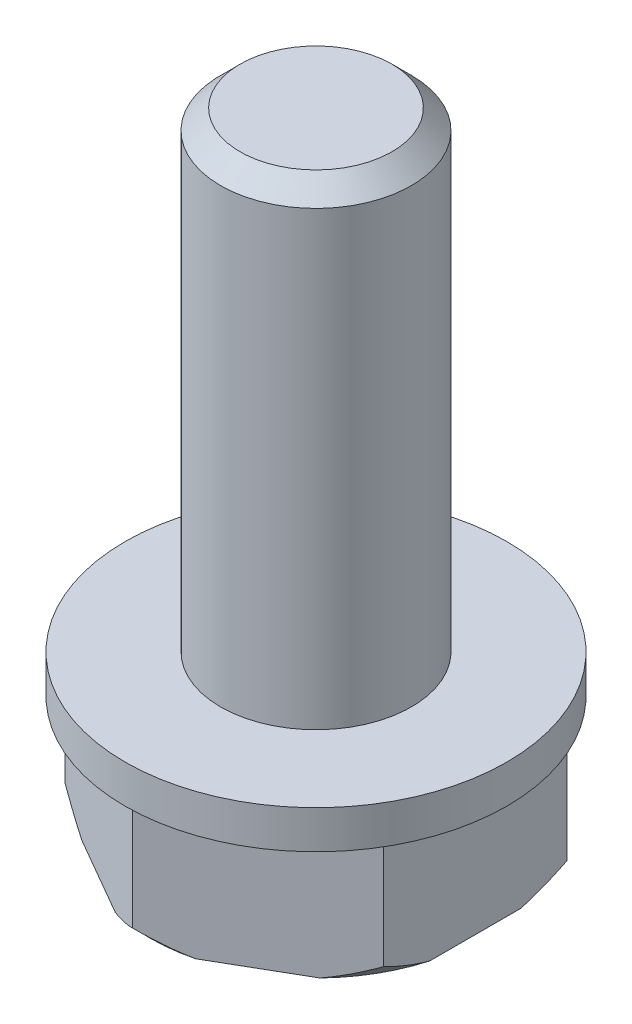
ISO-10303-21;
HEADER;
FILE_DESCRIPTION(('STEP AP214'),'2;1');
FILE_NAME('part.step','',(''),(''),'','','');
FILE_SCHEMA(('AUTOMOTIVE_DESIGN { 1 0 10303 214 1 1 1 1 }'));
ENDSEC;
DATA;
#1=APPLICATION_CONTEXT('core data for automotive mechanical design processes');
#2=APPLICATION_PROTOCOL_DEFINITION('international standard','automotive_design',2000,#1);
#3=PRODUCT_CONTEXT('',#1,'mechanical');
#4=PRODUCT('Part','Part','',(#3));
#5=PRODUCT_RELATED_PRODUCT_CATEGORY('part','',(#4));
#6=PRODUCT_DEFINITION_FORMATION('','',#4);
#7=PRODUCT_DEFINITION_CONTEXT('part definition',#1,'design');
#8=PRODUCT_DEFINITION('design','',#6,#7);
#9=PRODUCT_DEFINITION_SHAPE('','',#8);
#10=(LENGTH_UNIT() NAMED_UNIT(*) SI_UNIT(.MILLI.,.METRE.));
#11=(NAMED_UNIT(*) PLANE_ANGLE_UNIT() SI_UNIT($,.RADIAN.));
#12=(NAMED_UNIT(*) SI_UNIT($,.STERADIAN.) SOLID_ANGLE_UNIT());
#13=UNCERTAINTY_MEASURE_WITH_UNIT(LENGTH_MEASURE(1.E-05),#10,'distance_accuracy_value','');
#14=(GEOMETRIC_REPRESENTATION_CONTEXT(3) GLOBAL_UNCERTAINTY_ASSIGNED_CONTEXT((#13)) GLOBAL_UNIT_ASSIGNED_CONTEXT((#10,
#11,#12)) REPRESENTATION_CONTEXT('',''));
#15=CARTESIAN_POINT('',(0.,0.,0.));
#16=DIRECTION('',(0.,0.,1.));
#17=DIRECTION('',(1.,0.,0.));
#18=AXIS2_PLACEMENT_3D('',#15,#16,#17);
#19=CARTESIAN_POINT('',(22.6776695296637,96.5,-20.5644208756118));
#20=DIRECTION('',(-0.5,0.,0.866025403784439));
#21=DIRECTION('',(0.866025403784439,0.,0.5));
#22=AXIS2_PLACEMENT_3D('',#19,#20,#21);
#23=PLANE('',#22);
#24=DIRECTION('',(0.,-1.,0.));
#25=VECTOR('',#24,1.);
#26=CARTESIAN_POINT('',(22.6776695296637,96.5,-20.5644208756118));
#27=LINE('',#26,#25);
#28=CARTESIAN_POINT('',(22.6776695296637,50.5,-20.5644208756118));
#29=VERTEX_POINT('',#28);
#30=CARTESIAN_POINT('',(22.6776695296637,47.0735026918963,-20.5644208756118));
#31=VERTEX_POINT('',#30);
#32=EDGE_CURVE('E11',#29,#31,#27,.T.);
#33=ORIENTED_EDGE('',*,*,#32,.T.);
#34=CARTESIAN_POINT('',(21.414601217349,46.5,-21.2936537057316));
#35=CARTESIAN_POINT('',(21.4664537594648,46.5164440766261,-21.2637151211004));
#36=CARTESIAN_POINT('',(21.5180895158105,46.5337687545802,-21.2338904269128));
#37=CARTESIAN_POINT('',(21.6214874574526,46.5702823086314,-21.1741594018992));
#38=CARTESIAN_POINT('',(21.6732446970938,46.5894897238432,-21.1442558321939));
#39=CARTESIAN_POINT('',(21.7769756621481,46.6297670931507,-21.0843293780453));
#40=CARTESIAN_POINT('',(21.8289432219275,46.6508582920278,-21.054310131997));
#41=CARTESIAN_POINT('',(21.9331790081629,46.6949003649628,-20.9941094242253));
#42=CARTESIAN_POINT('',(21.9854399260141,46.7178745106764,-20.9639323574686));
#43=CARTESIAN_POINT('',(22.0903392794409,46.7656807395659,-20.9033725653862));
#44=CARTESIAN_POINT('',(22.1429693499514,46.7905375181192,-20.8729948770988));
#45=CARTESIAN_POINT('',(22.2486773209186,46.8421079012049,-20.8119895662206));
#46=CARTESIAN_POINT('',(22.3017459168783,46.8688470805479,-20.7813674698508));
#47=CARTESIAN_POINT('',(22.4083946755418,46.9241810640024,-20.7198294215317));
#48=CARTESIAN_POINT('',(22.4619647196344,46.9528018406309,-20.6889193342318));
#49=CARTESIAN_POINT('',(22.56967482855,47.0119007649667,-20.6267615953025));
#50=CARTESIAN_POINT('',(22.6238041115768,47.042404941688,-20.5955199875061));
#51=CARTESIAN_POINT('',(22.6776695296637,47.0735026918963,-20.5644208756118));
#52=B_SPLINE_CURVE_WITH_KNOTS('',3,(#34,#35,#36,#37,#38,#39,#40,#41,#42,#43,#44,#45,#46,#47,#48,
#49,#50,#51),.UNSPECIFIED.,.F.,.F.,(4,2,2,2,2,2,2,2,4),(0.,0.186265222277089,0.374595608167023,
0.565412784427937,0.7591112321157,0.956057798253867,1.15659171756842,1.36102506604504,
1.56964356219137),.UNSPECIFIED.);
#53=CARTESIAN_POINT('',(21.414601217349,46.5,-21.2936537057316));
#54=VERTEX_POINT('',#53);
#55=EDGE_CURVE('E443',#54,#31,#52,.T.);
#56=ORIENTED_EDGE('',*,*,#55,.F.);
#57=DIRECTION('',(0.866025403784439,0.,0.5));
#58=VECTOR('',#57,1.);
#59=CARTESIAN_POINT('',(24.0776695296637,46.5,-19.7561304987464));
#60=LINE('',#59,#58);
#61=CARTESIAN_POINT('',(18.9407378419784,46.5,-22.7219393914402));
#62=VERTEX_POINT('',#61);
#63=EDGE_CURVE('E427',#62,#54,#60,.T.);
#64=ORIENTED_EDGE('',*,*,#63,.F.);
#65=CARTESIAN_POINT('',(17.6776695296637,47.0735026918963,-23.45117222156));
#66=CARTESIAN_POINT('',(17.7315348596427,47.042404941688,-23.4200729570584));
#67=CARTESIAN_POINT('',(17.7856555271629,47.0119007649667,-23.3888164267667));
#68=CARTESIAN_POINT('',(17.8933407625753,46.9528018406309,-23.326615605666));
#69=CARTESIAN_POINT('',(17.9468947054565,46.9241810640024,-23.29567763025));
#70=CARTESIAN_POINT('',(18.0535125979319,46.8688470805479,-23.2340861201248));
#71=CARTESIAN_POINT('',(18.1065664092851,46.8421079012049,-23.2034384160655));
#72=CARTESIAN_POINT('',(18.212252543755,46.7905375181192,-23.1423952832645));
#73=CARTESIAN_POINT('',(18.2648754287754,46.7656807395659,-23.1120051493432));
#74=CARTESIAN_POINT('',(18.3697714238801,46.7178745106764,-23.0514395404762));
#75=CARTESIAN_POINT('',(18.4220359892286,46.6949003649628,-23.0212687913703));
#76=CARTESIAN_POINT('',(18.5262892246024,46.6508582920278,-22.9610983063928));
#77=CARTESIAN_POINT('',(18.5782704341725,46.6297670931507,-22.9311027024754));
#78=CARTESIAN_POINT('',(18.682033748351,46.5894897238432,-22.8712322786535));
#79=CARTESIAN_POINT('',(18.7338096192003,46.5702823086314,-22.8413609791471));
#80=CARTESIAN_POINT('',(18.8372371750771,46.5337687545802,-22.7816812474928));
#81=CARTESIAN_POINT('',(18.8888839960765,46.5164440766261,-22.7518757178476));
#82=CARTESIAN_POINT('',(18.9407378419784,46.5,-22.7219393914402));
#83=B_SPLINE_CURVE_WITH_KNOTS('',3,(#65,#66,#67,#68,#69,#70,#71,#72,#73,#74,#75,#76,#77,#78,#79,
#80,#81,#82),.UNSPECIFIED.,.F.,.F.,(4,2,2,2,2,2,2,2,4),(0.,0.208618496146344,0.413051844622974,
0.613585763937537,0.810532330075709,1.00423077776348,1.19504795402439,1.38337833991432,
1.5696435621914),.UNSPECIFIED.);
#84=CARTESIAN_POINT('',(17.6776695296637,47.0735026918963,-23.4511722215599));
#85=VERTEX_POINT('',#84);
#86=EDGE_CURVE('E442',#85,#62,#83,.T.);
#87=ORIENTED_EDGE('',*,*,#86,.F.);
#88=DIRECTION('',(0.,-1.,0.));
#89=VECTOR('',#88,1.);
#90=CARTESIAN_POINT('',(17.6776695296637,96.5,-23.4511722215599));
#91=LINE('',#90,#89);
#92=CARTESIAN_POINT('',(17.6776695296637,50.5,-23.4511722215599));
#93=VERTEX_POINT('',#92);
#94=EDGE_CURVE('E418',#93,#85,#91,.T.);
#95=ORIENTED_EDGE('',*,*,#94,.F.);
#96=DIRECTION('',(-0.866025403784439,0.,-0.5));
#97=VECTOR('',#96,1.);
#98=CARTESIAN_POINT('',(22.4276695296637,50.5,-20.7087584429092));
#99=LINE('',#98,#97);
#100=EDGE_CURVE('E231',#29,#93,#99,.T.);
#101=ORIENTED_EDGE('',*,*,#100,.F.);
#102=EDGE_LOOP('',(#33,#56,#64,#87,#95,#101));
#103=FACE_BOUND('',#102,.T.);
#104=ADVANCED_FACE('F16',(#103),#23,.F.);
#105=CARTESIAN_POINT('',(22.6776695296637,96.5,-14.7909181837156));
#106=DIRECTION('',(-1.,0.,0.));
#107=DIRECTION('',(0.,0.,1.));
#108=AXIS2_PLACEMENT_3D('',#105,#106,#107);
#109=PLANE('',#108);
#110=DIRECTION('',(0.,-1.,0.));
#111=VECTOR('',#110,1.);
#112=CARTESIAN_POINT('',(22.6776695296637,96.5,-14.7909181837156));
#113=LINE('',#112,#111);
#114=CARTESIAN_POINT('',(22.6776695296637,50.5,-14.7909181837156));
#115=VERTEX_POINT('',#114);
#116=CARTESIAN_POINT('',(22.6776695296637,47.0735026918963,-14.7909181837156));
#117=VERTEX_POINT('',#116);
#118=EDGE_CURVE('E154',#115,#117,#113,.T.);
#119=ORIENTED_EDGE('',*,*,#118,.T.);
#120=CARTESIAN_POINT('',(22.6776695296637,46.5,-16.2493838439551));
#121=CARTESIAN_POINT('',(22.6776682258776,46.5164440766261,-16.1895089329165));
#122=CARTESIAN_POINT('',(22.6776571612239,46.5337687545802,-16.1298787090837));
#123=CARTESIAN_POINT('',(22.6776275469891,46.5702823086314,-16.0104679524158));
#124=CARTESIAN_POINT('',(22.6776089157811,46.5894897238432,-15.9506930832041));
#125=CARTESIAN_POINT('',(22.6775765666569,46.6297670931507,-15.8308962052337));
#126=CARTESIAN_POINT('',(22.6775629168662,46.6508582920278,-15.7708813552678));
#127=CARTESIAN_POINT('',(22.6775454677278,46.6949003649628,-15.6505101625187));
#128=CARTESIAN_POINT('',(22.6775418202305,46.7178745106764,-15.5901623466562));
#129=CARTESIAN_POINT('',(22.6775451785526,46.7656807395659,-15.4690369457068));
#130=CARTESIAN_POINT('',(22.6775523640427,46.7905375181192,-15.4082691234981));
#131=CARTESIAN_POINT('',(22.67757420054,46.8421079012049,-15.2862206798188));
#132=CARTESIAN_POINT('',(22.6775889851464,46.8688470805479,-15.2249508793897));
#133=CARTESIAN_POINT('',(22.6776198513346,46.9241810640024,-15.1018213209455));
#134=CARTESIAN_POINT('',(22.677635952546,46.9528018406309,-15.0399732582295));
#135=CARTESIAN_POINT('',(22.6776608260492,47.0119007649667,-14.9156146981995));
#136=CARTESIAN_POINT('',(22.6776694415558,47.042404941688,-14.8531165601114));
#137=CARTESIAN_POINT('',(22.6776695296637,47.0735026918963,-14.7909181837156));
#138=B_SPLINE_CURVE_WITH_KNOTS('',3,(#120,#121,#122,#123,#124,#125,#126,#127,#128,#129,#130,
#131,#132,#133,#134,#135,#136,#137),.UNSPECIFIED.,.F.,.F.,(4,2,2,2,2,2,2,2,4),(0.,
0.186265222277086,0.37459560816702,0.565412784427934,0.759111232115696,0.956057798253867,
1.15659171756843,1.36102506604505,1.56964356219139),.UNSPECIFIED.);
#139=CARTESIAN_POINT('',(22.6776695296637,46.5,-16.2493838439551));
#140=VERTEX_POINT('',#139);
#141=EDGE_CURVE('E29',#140,#117,#138,.T.);
#142=ORIENTED_EDGE('',*,*,#141,.F.);
#143=DIRECTION('',(0.,0.,1.));
#144=VECTOR('',#143,1.);
#145=CARTESIAN_POINT('',(22.6776695296637,46.5,-17.6776695296637));
#146=LINE('',#145,#144);
#147=CARTESIAN_POINT('',(22.6776695296637,46.5,-19.1059552153723));
#148=VERTEX_POINT('',#147);
#149=EDGE_CURVE('E434',#148,#140,#146,.T.);
#150=ORIENTED_EDGE('',*,*,#149,.F.);
#151=CARTESIAN_POINT('',(22.6776695296637,47.0735026918963,-20.5644208756118));
#152=CARTESIAN_POINT('',(22.6776694415558,47.0424049416879,-20.502222499216));
#153=CARTESIAN_POINT('',(22.6776608260492,47.0119007649667,-20.4397243611279));
#154=CARTESIAN_POINT('',(22.677635952546,46.9528018406309,-20.3153658010979));
#155=CARTESIAN_POINT('',(22.6776198513346,46.9241810640024,-20.2535177383819));
#156=CARTESIAN_POINT('',(22.6775889851464,46.8688470805479,-20.1303881799377));
#157=CARTESIAN_POINT('',(22.67757420054,46.8421079012049,-20.0691183795086));
#158=CARTESIAN_POINT('',(22.6775523640427,46.7905375181192,-19.9470699358293));
#159=CARTESIAN_POINT('',(22.6775451785526,46.7656807395659,-19.8863021136206));
#160=CARTESIAN_POINT('',(22.6775418202304,46.7178745106764,-19.7651767126712));
#161=CARTESIAN_POINT('',(22.6775454677278,46.6949003649628,-19.7048288968087));
#162=CARTESIAN_POINT('',(22.6775629168662,46.6508582920278,-19.5844577040595));
#163=CARTESIAN_POINT('',(22.6775765666568,46.6297670931507,-19.5244428540937));
#164=CARTESIAN_POINT('',(22.6776089157811,46.5894897238432,-19.4046459761233));
#165=CARTESIAN_POINT('',(22.6776275469891,46.5702823086314,-19.3448711069116));
#166=CARTESIAN_POINT('',(22.6776571612239,46.5337687545802,-19.2254603502437));
#167=CARTESIAN_POINT('',(22.6776682258776,46.5164440766261,-19.1658301264109));
#168=CARTESIAN_POINT('',(22.6776695296637,46.5,-19.1059552153723));
#169=B_SPLINE_CURVE_WITH_KNOTS('',3,(#151,#152,#153,#154,#155,#156,#157,#158,#159,#160,#161,
#162,#163,#164,#165,#166,#167,#168),.UNSPECIFIED.,.F.,.F.,(4,2,2,2,2,2,2,2,4),(0.,
0.208618496146355,0.413051844622993,0.613585763937558,0.810532330075726,1.00423077776349,
1.19504795402439,1.38337833991431,1.56964356219138),.UNSPECIFIED.);
#170=EDGE_CURVE('E448',#31,#148,#169,.T.);
#171=ORIENTED_EDGE('',*,*,#170,.F.);
#172=ORIENTED_EDGE('',*,*,#32,.F.);
#173=DIRECTION('',(0.,0.,-1.));
#174=VECTOR('',#173,1.);
#175=CARTESIAN_POINT('',(22.6776695296637,50.5,-17.6776695296637));
#176=LINE('',#175,#174);
#177=EDGE_CURVE('E235',#115,#29,#176,.T.);
#178=ORIENTED_EDGE('',*,*,#177,.F.);
#179=EDGE_LOOP('',(#119,#142,#150,#171,#172,#178));
#180=FACE_BOUND('',#179,.T.);
#181=ADVANCED_FACE('F267',(#180),#109,.F.);
#182=CARTESIAN_POINT('',(17.6776695296637,47.3,-17.6776695296637));
#183=DIRECTION('',(0.,1.,0.));
#184=DIRECTION('',(0.,0.,1.));
#185=AXIS2_PLACEMENT_3D('',#182,#183,#184);
#186=CONICAL_SURFACE('',#185,6.,0.785398163397448);
#187=CARTESIAN_POINT('',(17.6776695296637,46.5,-17.6776695296637));
#188=DIRECTION('',(0.,-1.,0.));
#189=DIRECTION('',(0.,0.,-1.));
#190=AXIS2_PLACEMENT_3D('',#187,#188,#189);
#191=CIRCLE('',#190,5.2);
#192=CARTESIAN_POINT('',(21.414601217349,46.5,-14.0616853535958));
#193=VERTEX_POINT('',#192);
#194=EDGE_CURVE('E220',#140,#193,#191,.T.);
#195=ORIENTED_EDGE('',*,*,#194,.F.);
#196=ORIENTED_EDGE('',*,*,#141,.T.);
#197=CARTESIAN_POINT('',(22.6776695296637,47.0735026918963,-14.7909181837156));
#198=CARTESIAN_POINT('',(22.6238041115768,47.042404941688,-14.7598190718213));
#199=CARTESIAN_POINT('',(22.56967482855,47.0119007649667,-14.7285774640249));
#200=CARTESIAN_POINT('',(22.4619647196343,46.9528018406309,-14.6664197250956));
#201=CARTESIAN_POINT('',(22.4083946755418,46.9241810640024,-14.6355096377956));
#202=CARTESIAN_POINT('',(22.3017459168782,46.8688470805479,-14.5739715894766));
#203=CARTESIAN_POINT('',(22.2486773209186,46.8421079012049,-14.5433494931068));
#204=CARTESIAN_POINT('',(22.1429693499514,46.7905375181192,-14.4823441822286));
#205=CARTESIAN_POINT('',(22.0903392794409,46.7656807395659,-14.4519664939412));
#206=CARTESIAN_POINT('',(21.9854399260141,46.7178745106764,-14.3914067018588));
#207=CARTESIAN_POINT('',(21.9331790081629,46.6949003649628,-14.3612296351021));
#208=CARTESIAN_POINT('',(21.8289432219275,46.6508582920278,-14.3010289273304));
#209=CARTESIAN_POINT('',(21.7769756621481,46.6297670931507,-14.2710096812821));
#210=CARTESIAN_POINT('',(21.6732446970938,46.5894897238432,-14.2110832271335));
#211=CARTESIAN_POINT('',(21.6214874574526,46.5702823086314,-14.1811796574282));
#212=CARTESIAN_POINT('',(21.5180895158105,46.5337687545802,-14.1214486324146));
#213=CARTESIAN_POINT('',(21.4664537594648,46.5164440766261,-14.091623938227));
#214=CARTESIAN_POINT('',(21.414601217349,46.5,-14.0616853535958));
#215=B_SPLINE_CURVE_WITH_KNOTS('',3,(#197,#198,#199,#200,#201,#202,#203,#204,#205,#206,#207,
#208,#209,#210,#211,#212,#213,#214),.UNSPECIFIED.,.F.,.F.,(4,2,2,2,2,2,2,2,4),(0.,
0.208618496146342,0.413051844622972,0.613585763937532,0.810532330075702,1.00423077776346,
1.19504795402437,1.3833783399143,1.56964356219138),.UNSPECIFIED.);
#216=EDGE_CURVE('E211',#117,#193,#215,.T.);
#217=ORIENTED_EDGE('',*,*,#216,.T.);
#218=EDGE_LOOP('',(#195,#196,#217));
#219=FACE_BOUND('',#218,.T.);
#220=ADVANCED_FACE('F256',(#219),#186,.T.);
#221=CARTESIAN_POINT('',(17.6776695296637,47.3,-17.6776695296637));
#222=DIRECTION('',(0.,1.,0.));
#223=DIRECTION('',(0.,0.,1.));
#224=AXIS2_PLACEMENT_3D('',#221,#222,#223);
#225=CONICAL_SURFACE('',#224,6.,0.785398163397448);
#226=CARTESIAN_POINT('',(17.6776695296637,46.5,-17.6776695296637));
#227=DIRECTION('',(0.,-1.,0.));
#228=DIRECTION('',(0.,0.,-1.));
#229=AXIS2_PLACEMENT_3D('',#226,#227,#228);
#230=CIRCLE('',#229,5.2);
#231=EDGE_CURVE('E430',#54,#148,#230,.T.);
#232=ORIENTED_EDGE('',*,*,#231,.F.);
#233=ORIENTED_EDGE('',*,*,#55,.T.);
#234=ORIENTED_EDGE('',*,*,#170,.T.);
#235=EDGE_LOOP('',(#232,#233,#234));
#236=FACE_BOUND('',#235,.T.);
#237=ADVANCED_FACE('F266',(#236),#225,.T.);
#238=CARTESIAN_POINT('',(17.6776695296637,47.3,-17.6776695296637));
#239=DIRECTION('',(0.,1.,0.));
#240=DIRECTION('',(0.,0.,1.));
#241=AXIS2_PLACEMENT_3D('',#238,#239,#240);
#242=CONICAL_SURFACE('',#241,6.,0.785398163397448);
#243=CARTESIAN_POINT('',(17.6776695296637,46.5,-17.6776695296637));
#244=DIRECTION('',(0.,-1.,0.));
#245=DIRECTION('',(0.,0.,-1.));
#246=AXIS2_PLACEMENT_3D('',#243,#244,#245);
#247=CIRCLE('',#246,5.2);
#248=CARTESIAN_POINT('',(16.414601217349,46.5,-22.7219393914402));
#249=VERTEX_POINT('',#248);
#250=EDGE_CURVE('E406',#249,#62,#247,.T.);
#251=ORIENTED_EDGE('',*,*,#250,.F.);
#252=CARTESIAN_POINT('',(16.414601217349,46.5,-22.7219393914402));
#253=CARTESIAN_POINT('',(16.4664550632509,46.5164440766261,-22.7518757178476));
#254=CARTESIAN_POINT('',(16.5181018842503,46.5337687545802,-22.7816812474928));
#255=CARTESIAN_POINT('',(16.6215294401272,46.5702823086314,-22.8413609791471));
#256=CARTESIAN_POINT('',(16.6733053109764,46.5894897238432,-22.8712322786535));
#257=CARTESIAN_POINT('',(16.777068625155,46.6297670931507,-22.9311027024754));
#258=CARTESIAN_POINT('',(16.829049834725,46.6508582920278,-22.9610983063928));
#259=CARTESIAN_POINT('',(16.9333030700988,46.6949003649628,-23.0212687913703));
#260=CARTESIAN_POINT('',(16.9855676354474,46.7178745106764,-23.0514395404762));
#261=CARTESIAN_POINT('',(17.090463630552,46.7656807395659,-23.1120051493432));
#262=CARTESIAN_POINT('',(17.1430865155724,46.7905375181192,-23.1423952832645));
#263=CARTESIAN_POINT('',(17.2487726500423,46.8421079012049,-23.2034384160655));
#264=CARTESIAN_POINT('',(17.3018264613955,46.8688470805479,-23.2340861201248));
#265=CARTESIAN_POINT('',(17.4084443538709,46.9241810640024,-23.29567763025));
#266=CARTESIAN_POINT('',(17.4619982967521,46.9528018406309,-23.326615605666));
#267=CARTESIAN_POINT('',(17.5696835321645,47.0119007649667,-23.3888164267667));
#268=CARTESIAN_POINT('',(17.6238041996847,47.042404941688,-23.4200729570583));
#269=CARTESIAN_POINT('',(17.6776695296637,47.0735026918963,-23.45117222156));
#270=B_SPLINE_CURVE_WITH_KNOTS('',3,(#252,#253,#254,#255,#256,#257,#258,#259,#260,#261,#262,
#263,#264,#265,#266,#267,#268,#269),.UNSPECIFIED.,.F.,.F.,(4,2,2,2,2,2,2,2,4),(0.,
0.186265222277085,0.374595608167022,0.565412784427936,0.759111232115702,0.956057798253874,
1.15659171756843,1.36102506604505,1.56964356219139),.UNSPECIFIED.);
#271=EDGE_CURVE('E374',#249,#85,#270,.T.);
#272=ORIENTED_EDGE('',*,*,#271,.T.);
#273=ORIENTED_EDGE('',*,*,#86,.T.);
#274=EDGE_LOOP('',(#251,#272,#273));
#275=FACE_BOUND('',#274,.T.);
#276=ADVANCED_FACE('F346',(#275),#242,.T.);
#277=CARTESIAN_POINT('',(17.6776695296637,51.7,-17.6776695296637));
#278=DIRECTION('',(0.,-1.,0.));
#279=DIRECTION('',(0.,0.,-1.));
#280=AXIS2_PLACEMENT_3D('',#277,#278,#279);
#281=PLANE('',#280);
#282=CARTESIAN_POINT('',(17.6776695296637,51.7,-17.6776695296637));
#283=DIRECTION('',(0.,-1.,0.));
#284=DIRECTION('',(0.,0.,-1.));
#285=AXIS2_PLACEMENT_3D('',#282,#283,#284);
#286=CIRCLE('',#285,3.);
#287=CARTESIAN_POINT('',(17.6776695296637,51.7,-20.6776695296637));
#288=VERTEX_POINT('',#287);
#289=EDGE_CURVE('E132',#288,#288,#286,.T.);
#290=ORIENTED_EDGE('',*,*,#289,.T.);
#291=EDGE_LOOP('',(#290));
#292=FACE_BOUND('',#291,.T.);
#293=CARTESIAN_POINT('',(17.6776695296637,51.7,-17.6776695296637));
#294=DIRECTION('',(0.,-1.,0.));
#295=DIRECTION('',(0.,0.,-1.));
#296=AXIS2_PLACEMENT_3D('',#293,#294,#295);
#297=CIRCLE('',#296,6.);
#298=CARTESIAN_POINT('',(17.6776695296637,51.7,-23.6776695296637));
#299=VERTEX_POINT('',#298);
#300=EDGE_CURVE('E228',#299,#299,#297,.T.);
#301=ORIENTED_EDGE('',*,*,#300,.F.);
#302=EDGE_LOOP('',(#301));
#303=FACE_BOUND('',#302,.T.);
#304=ADVANCED_FACE('F300',(#292,#303),#281,.F.);
#305=CARTESIAN_POINT('',(17.6776695296637,47.3,-17.6776695296637));
#306=DIRECTION('',(0.,1.,0.));
#307=DIRECTION('',(0.,0.,1.));
#308=AXIS2_PLACEMENT_3D('',#305,#306,#307);
#309=CONICAL_SURFACE('',#308,6.,0.785398163397448);
#310=CARTESIAN_POINT('',(17.6776695296637,46.5,-17.6776695296637));
#311=DIRECTION('',(0.,-1.,0.));
#312=DIRECTION('',(0.,0.,-1.));
#313=AXIS2_PLACEMENT_3D('',#310,#311,#312);
#314=CIRCLE('',#313,5.2);
#315=CARTESIAN_POINT('',(12.6776695296637,46.5,-19.1059552153723));
#316=VERTEX_POINT('',#315);
#317=CARTESIAN_POINT('',(13.9407378419784,46.5,-21.2936537057316));
#318=VERTEX_POINT('',#317);
#319=EDGE_CURVE('E328',#316,#318,#314,.T.);
#320=ORIENTED_EDGE('',*,*,#319,.F.);
#321=CARTESIAN_POINT('',(12.6776695296637,46.5,-19.1059552153723));
#322=CARTESIAN_POINT('',(12.6776708334498,46.5164440766261,-19.165830126411));
#323=CARTESIAN_POINT('',(12.6776818981035,46.5337687545802,-19.2254603502438));
#324=CARTESIAN_POINT('',(12.6777115123383,46.5702823086314,-19.3448711069116));
#325=CARTESIAN_POINT('',(12.6777301435463,46.5894897238432,-19.4046459761234));
#326=CARTESIAN_POINT('',(12.6777624926705,46.6297670931507,-19.5244428540937));
#327=CARTESIAN_POINT('',(12.6777761424612,46.6508582920278,-19.5844577040596));
#328=CARTESIAN_POINT('',(12.6777935915996,46.6949003649628,-19.7048288968087));
#329=CARTESIAN_POINT('',(12.677797239097,46.7178745106764,-19.7651767126713));
#330=CARTESIAN_POINT('',(12.6777938807748,46.7656807395659,-19.8863021136206));
#331=CARTESIAN_POINT('',(12.6777866952847,46.7905375181192,-19.9470699358294));
#332=CARTESIAN_POINT('',(12.6777648587874,46.8421079012049,-20.0691183795086));
#333=CARTESIAN_POINT('',(12.677750074181,46.8688470805479,-20.1303881799377));
#334=CARTESIAN_POINT('',(12.6777192079928,46.9241810640024,-20.2535177383819));
#335=CARTESIAN_POINT('',(12.6777031067814,46.9528018406309,-20.3153658010979));
#336=CARTESIAN_POINT('',(12.6776782332782,47.0119007649667,-20.4397243611279));
#337=CARTESIAN_POINT('',(12.6776696177716,47.042404941688,-20.502222499216));
#338=CARTESIAN_POINT('',(12.6776695296637,47.0735026918963,-20.5644208756118));
#339=B_SPLINE_CURVE_WITH_KNOTS('',3,(#321,#322,#323,#324,#325,#326,#327,#328,#329,#330,#331,
#332,#333,#334,#335,#336,#337,#338),.UNSPECIFIED.,.F.,.F.,(4,2,2,2,2,2,2,2,4),(0.,
0.186265222277079,0.37459560816701,0.565412784427924,0.759111232115682,0.956057798253853,
1.15659171756841,1.36102506604504,1.56964356219137),.UNSPECIFIED.);
#340=CARTESIAN_POINT('',(12.6776695296637,47.0735026918963,-20.5644208756118));
#341=VERTEX_POINT('',#340);
#342=EDGE_CURVE('E400',#316,#341,#339,.T.);
#343=ORIENTED_EDGE('',*,*,#342,.T.);
#344=CARTESIAN_POINT('',(12.6776695296637,47.0735026918963,-20.5644208756118));
#345=CARTESIAN_POINT('',(12.7315349477506,47.042404941688,-20.5955199875061));
#346=CARTESIAN_POINT('',(12.7856642307774,47.0119007649667,-20.6267615953026));
#347=CARTESIAN_POINT('',(12.8933743396931,46.9528018406309,-20.6889193342319));
#348=CARTESIAN_POINT('',(12.9469443837857,46.9241810640024,-20.7198294215318));
#349=CARTESIAN_POINT('',(13.0535931424492,46.8688470805479,-20.7813674698508));
#350=CARTESIAN_POINT('',(13.1066617384088,46.8421079012049,-20.8119895662206));
#351=CARTESIAN_POINT('',(13.212369709376,46.7905375181192,-20.8729948770989));
#352=CARTESIAN_POINT('',(13.2649997798865,46.7656807395659,-20.9033725653862));
#353=CARTESIAN_POINT('',(13.3698991333133,46.7178745106764,-20.9639323574686));
#354=CARTESIAN_POINT('',(13.4221600511645,46.6949003649628,-20.9941094242253));
#355=CARTESIAN_POINT('',(13.5263958373999,46.6508582920278,-21.054310131997));
#356=CARTESIAN_POINT('',(13.5783633971793,46.6297670931507,-21.0843293780454));
#357=CARTESIAN_POINT('',(13.6820943622336,46.5894897238432,-21.1442558321939));
#358=CARTESIAN_POINT('',(13.7338516018749,46.5702823086314,-21.1741594018992));
#359=CARTESIAN_POINT('',(13.8372495435169,46.5337687545802,-21.2338904269128));
#360=CARTESIAN_POINT('',(13.8888852998626,46.5164440766261,-21.2637151211004));
#361=CARTESIAN_POINT('',(13.9407378419784,46.5,-21.2936537057316));
#362=B_SPLINE_CURVE_WITH_KNOTS('',3,(#344,#345,#346,#347,#348,#349,#350,#351,#352,#353,#354,
#355,#356,#357,#358,#359,#360,#361),.UNSPECIFIED.,.F.,.F.,(4,2,2,2,2,2,2,2,4),(0.,
0.208618496146346,0.413051844622972,0.61358576393753,0.810532330075706,1.00423077776346,
1.19504795402438,1.3833783399143,1.56964356219138),.UNSPECIFIED.);
#363=EDGE_CURVE('E414',#341,#318,#362,.T.);
#364=ORIENTED_EDGE('',*,*,#363,.T.);
#365=EDGE_LOOP('',(#320,#343,#364));
#366=FACE_BOUND('',#365,.T.);
#367=ADVANCED_FACE('F268',(#366),#309,.T.);
#368=CARTESIAN_POINT('',(17.6776695296637,50.5,-17.6776695296637));
#369=DIRECTION('',(0.,-1.,0.));
#370=DIRECTION('',(0.,0.,-1.));
#371=AXIS2_PLACEMENT_3D('',#368,#369,#370);
#372=CYLINDRICAL_SURFACE('',#371,6.);
#373=ORIENTED_EDGE('',*,*,#300,.T.);
#374=EDGE_LOOP('',(#373));
#375=FACE_BOUND('',#374,.T.);
#376=CARTESIAN_POINT('',(17.6776695296637,50.5,-17.6776695296637));
#377=DIRECTION('',(0.,-1.,0.));
#378=DIRECTION('',(0.,0.,-1.));
#379=AXIS2_PLACEMENT_3D('',#376,#377,#378);
#380=CIRCLE('',#379,6.);
#381=CARTESIAN_POINT('',(17.6776695296637,50.5,-23.6776695296637));
#382=VERTEX_POINT('',#381);
#383=EDGE_CURVE('E239',#382,#382,#380,.T.);
#384=ORIENTED_EDGE('',*,*,#383,.F.);
#385=EDGE_LOOP('',(#384));
#386=FACE_BOUND('',#385,.T.);
#387=ADVANCED_FACE('F344',(#375,#386),#372,.T.);
#388=CARTESIAN_POINT('',(17.6776695296637,96.5,-23.4511722215599));
#389=DIRECTION('',(0.5,0.,0.866025403784439));
#390=DIRECTION('',(0.866025403784439,0.,-0.5));
#391=AXIS2_PLACEMENT_3D('',#388,#389,#390);
#392=PLANE('',#391);
#393=ORIENTED_EDGE('',*,*,#94,.T.);
#394=ORIENTED_EDGE('',*,*,#271,.F.);
#395=DIRECTION('',(0.866025403784439,0.,-0.5));
#396=VECTOR('',#395,1.);
#397=CARTESIAN_POINT('',(19.0776695296637,46.5,-24.2594625984254));
#398=LINE('',#397,#396);
#399=EDGE_CURVE('E403',#318,#249,#398,.T.);
#400=ORIENTED_EDGE('',*,*,#399,.F.);
#401=ORIENTED_EDGE('',*,*,#363,.F.);
#402=DIRECTION('',(0.,-1.,0.));
#403=VECTOR('',#402,1.);
#404=CARTESIAN_POINT('',(12.6776695296637,96.5,-20.5644208756118));
#405=LINE('',#404,#403);
#406=CARTESIAN_POINT('',(12.6776695296637,50.5,-20.5644208756118));
#407=VERTEX_POINT('',#406);
#408=EDGE_CURVE('E241',#407,#341,#405,.T.);
#409=ORIENTED_EDGE('',*,*,#408,.F.);
#410=DIRECTION('',(-0.866025403784439,0.,0.5));
#411=VECTOR('',#410,1.);
#412=CARTESIAN_POINT('',(17.4276695296637,50.5,-23.3068346542625));
#413=LINE('',#412,#411);
#414=EDGE_CURVE('E234',#93,#407,#413,.T.);
#415=ORIENTED_EDGE('',*,*,#414,.F.);
#416=EDGE_LOOP('',(#393,#394,#400,#401,#409,#415));
#417=FACE_BOUND('',#416,.T.);
#418=ADVANCED_FACE('F343',(#417),#392,.F.);
#419=CARTESIAN_POINT('',(12.6776695296637,96.5,-20.5644208756118));
#420=DIRECTION('',(1.,0.,0.));
#421=DIRECTION('',(0.,0.,-1.));
#422=AXIS2_PLACEMENT_3D('',#419,#420,#421);
#423=PLANE('',#422);
#424=ORIENTED_EDGE('',*,*,#408,.T.);
#425=ORIENTED_EDGE('',*,*,#342,.F.);
#426=DIRECTION('',(0.,0.,-1.));
#427=VECTOR('',#426,1.);
#428=CARTESIAN_POINT('',(12.6776695296637,46.5,-17.6776695296637));
#429=LINE('',#428,#427);
#430=CARTESIAN_POINT('',(12.6776695296637,46.5,-16.2493838439551));
#431=VERTEX_POINT('',#430);
#432=EDGE_CURVE('E128',#431,#316,#429,.T.);
#433=ORIENTED_EDGE('',*,*,#432,.F.);
#434=CARTESIAN_POINT('',(12.6776695296637,47.0735026918963,-14.7909181837156));
#435=CARTESIAN_POINT('',(12.6776696177716,47.0424049416879,-14.8531165601114));
#436=CARTESIAN_POINT('',(12.6776782332782,47.0119007649667,-14.9156146981995));
#437=CARTESIAN_POINT('',(12.6777031067814,46.9528018406309,-15.0399732582295));
#438=CARTESIAN_POINT('',(12.6777192079928,46.9241810640024,-15.1018213209455));
#439=CARTESIAN_POINT('',(12.677750074181,46.8688470805479,-15.2249508793897));
#440=CARTESIAN_POINT('',(12.6777648587874,46.8421079012049,-15.2862206798188));
#441=CARTESIAN_POINT('',(12.6777866952847,46.7905375181192,-15.4082691234981));
#442=CARTESIAN_POINT('',(12.6777938807748,46.7656807395659,-15.4690369457068));
#443=CARTESIAN_POINT('',(12.677797239097,46.7178745106764,-15.5901623466562));
#444=CARTESIAN_POINT('',(12.6777935915996,46.6949003649628,-15.6505101625188));
#445=CARTESIAN_POINT('',(12.6777761424612,46.6508582920278,-15.7708813552679));
#446=CARTESIAN_POINT('',(12.6777624926706,46.6297670931507,-15.8308962052337));
#447=CARTESIAN_POINT('',(12.6777301435463,46.5894897238432,-15.9506930832041));
#448=CARTESIAN_POINT('',(12.6777115123383,46.5702823086314,-16.0104679524158));
#449=CARTESIAN_POINT('',(12.6776818981035,46.5337687545802,-16.1298787090837));
#450=CARTESIAN_POINT('',(12.6776708334498,46.5164440766261,-16.1895089329164));
#451=CARTESIAN_POINT('',(12.6776695296637,46.5,-16.2493838439551));
#452=B_SPLINE_CURVE_WITH_KNOTS('',3,(#434,#435,#436,#437,#438,#439,#440,#441,#442,#443,#444,
#445,#446,#447,#448,#449,#450,#451),.UNSPECIFIED.,.F.,.F.,(4,2,2,2,2,2,2,2,4),(0.,
0.208618496146364,0.413051844623001,0.613585763937566,0.810532330075742,1.0042307777635,
1.1950479540244,1.38337833991432,1.56964356219138),.UNSPECIFIED.);
#453=CARTESIAN_POINT('',(12.6776695296637,47.0735026918963,-14.7909181837156));
#454=VERTEX_POINT('',#453);
#455=EDGE_CURVE('E119',#454,#431,#452,.T.);
#456=ORIENTED_EDGE('',*,*,#455,.F.);
#457=DIRECTION('',(0.,-1.,0.));
#458=VECTOR('',#457,1.);
#459=CARTESIAN_POINT('',(12.6776695296637,96.5,-14.7909181837156));
#460=LINE('',#459,#458);
#461=CARTESIAN_POINT('',(12.6776695296637,50.5,-14.7909181837156));
#462=VERTEX_POINT('',#461);
#463=EDGE_CURVE('E126',#462,#454,#460,.T.);
#464=ORIENTED_EDGE('',*,*,#463,.F.);
#465=DIRECTION('',(0.,0.,1.));
#466=VECTOR('',#465,1.);
#467=CARTESIAN_POINT('',(12.6776695296637,50.5,-17.6776695296637));
#468=LINE('',#467,#466);
#469=EDGE_CURVE('E242',#407,#462,#468,.T.);
#470=ORIENTED_EDGE('',*,*,#469,.F.);
#471=EDGE_LOOP('',(#424,#425,#433,#456,#464,#470));
#472=FACE_BOUND('',#471,.T.);
#473=ADVANCED_FACE('F123',(#472),#423,.F.);
#474=CARTESIAN_POINT('',(23.6776695296637,50.5,-17.6776695296637));
#475=DIRECTION('',(0.,1.,0.));
#476=DIRECTION('',(0.,0.,1.));
#477=AXIS2_PLACEMENT_3D('',#474,#475,#476);
#478=PLANE('',#477);
#479=ORIENTED_EDGE('',*,*,#383,.T.);
#480=EDGE_LOOP('',(#479));
#481=FACE_BOUND('',#480,.T.);
#482=ORIENTED_EDGE('',*,*,#177,.T.);
#483=ORIENTED_EDGE('',*,*,#100,.T.);
#484=ORIENTED_EDGE('',*,*,#414,.T.);
#485=ORIENTED_EDGE('',*,*,#469,.T.);
#486=DIRECTION('',(0.866025403784439,0.,0.5));
#487=VECTOR('',#486,1.);
#488=CARTESIAN_POINT('',(17.4276695296637,50.5,-12.0485044050648));
#489=LINE('',#488,#487);
#490=CARTESIAN_POINT('',(17.6776695296637,50.5,-11.9041668377674));
#491=VERTEX_POINT('',#490);
#492=EDGE_CURVE('E150',#462,#491,#489,.T.);
#493=ORIENTED_EDGE('',*,*,#492,.T.);
#494=DIRECTION('',(0.866025403784439,0.,-0.5));
#495=VECTOR('',#494,1.);
#496=CARTESIAN_POINT('',(22.4276695296637,50.5,-14.6465806164181));
#497=LINE('',#496,#495);
#498=EDGE_CURVE('E151',#491,#115,#497,.T.);
#499=ORIENTED_EDGE('',*,*,#498,.T.);
#500=EDGE_LOOP('',(#482,#483,#484,#485,#493,#499));
#501=FACE_BOUND('',#500,.T.);
#502=ADVANCED_FACE('F342',(#481,#501),#478,.F.);
#503=CARTESIAN_POINT('',(17.6776695296637,66.5,-17.6776695296637));
#504=DIRECTION('',(0.,-1.,0.));
#505=DIRECTION('',(0.,0.,-1.));
#506=AXIS2_PLACEMENT_3D('',#503,#504,#505);
#507=CONICAL_SURFACE('',#506,2.3865,0.785398163397446);
#508=CARTESIAN_POINT('',(17.6776695296637,66.5,-17.6776695296637));
#509=DIRECTION('',(0.,-1.,0.));
#510=DIRECTION('',(0.,0.,-1.));
#511=AXIS2_PLACEMENT_3D('',#508,#509,#510);
#512=CIRCLE('',#511,2.3865);
#513=CARTESIAN_POINT('',(17.6776695296637,66.5,-20.0641695296637));
#514=VERTEX_POINT('',#513);
#515=EDGE_CURVE('E238',#514,#514,#512,.T.);
#516=ORIENTED_EDGE('',*,*,#515,.T.);
#517=EDGE_LOOP('',(#516));
#518=FACE_BOUND('',#517,.T.);
#519=CARTESIAN_POINT('',(17.6776695296637,65.8865,-17.6776695296637));
#520=DIRECTION('',(0.,-1.,0.));
#521=DIRECTION('',(0.,0.,-1.));
#522=AXIS2_PLACEMENT_3D('',#519,#520,#521);
#523=CIRCLE('',#522,3.);
#524=CARTESIAN_POINT('',(17.6776695296637,65.8865,-20.6776695296637));
#525=VERTEX_POINT('',#524);
#526=EDGE_CURVE('E244',#525,#525,#523,.T.);
#527=ORIENTED_EDGE('',*,*,#526,.F.);
#528=EDGE_LOOP('',(#527));
#529=FACE_BOUND('',#528,.T.);
#530=ADVANCED_FACE('F506',(#518,#529),#507,.T.);
#531=CARTESIAN_POINT('',(17.6776695296637,66.5,-17.6776695296637));
#532=DIRECTION('',(0.,-1.,0.));
#533=DIRECTION('',(0.,0.,-1.));
#534=AXIS2_PLACEMENT_3D('',#531,#532,#533);
#535=PLANE('',#534);
#536=ORIENTED_EDGE('',*,*,#515,.F.);
#537=EDGE_LOOP('',(#536));
#538=FACE_BOUND('',#537,.T.);
#539=ADVANCED_FACE('F188',(#538),#535,.F.);
#540=CARTESIAN_POINT('',(17.6776695296637,46.5,-17.6776695296637));
#541=DIRECTION('',(0.,-1.,0.));
#542=DIRECTION('',(0.,0.,-1.));
#543=AXIS2_PLACEMENT_3D('',#540,#541,#542);
#544=CYLINDRICAL_SURFACE('',#543,3.);
#545=ORIENTED_EDGE('',*,*,#526,.T.);
#546=EDGE_LOOP('',(#545));
#547=FACE_BOUND('',#546,.T.);
#548=ORIENTED_EDGE('',*,*,#289,.F.);
#549=EDGE_LOOP('',(#548));
#550=FACE_BOUND('',#549,.T.);
#551=ADVANCED_FACE('F185',(#547,#550),#544,.T.);
#552=CARTESIAN_POINT('',(17.6776695296637,47.3,-17.6776695296637));
#553=DIRECTION('',(0.,1.,0.));
#554=DIRECTION('',(0.,0.,1.));
#555=AXIS2_PLACEMENT_3D('',#552,#553,#554);
#556=CONICAL_SURFACE('',#555,6.,0.785398163397448);
#557=CARTESIAN_POINT('',(17.6776695296637,46.5,-17.6776695296637));
#558=DIRECTION('',(0.,-1.,0.));
#559=DIRECTION('',(0.,0.,-1.));
#560=AXIS2_PLACEMENT_3D('',#557,#558,#559);
#561=CIRCLE('',#560,5.2);
#562=CARTESIAN_POINT('',(18.9407378419784,46.5,-12.6333996678872));
#563=VERTEX_POINT('',#562);
#564=CARTESIAN_POINT('',(16.414601217349,46.5,-12.6333996678872));
#565=VERTEX_POINT('',#564);
#566=EDGE_CURVE('E133',#563,#565,#561,.T.);
#567=ORIENTED_EDGE('',*,*,#566,.F.);
#568=CARTESIAN_POINT('',(18.9407378419784,46.5,-12.6333996678872));
#569=CARTESIAN_POINT('',(18.8888839960765,46.5164440766261,-12.6034633414798));
#570=CARTESIAN_POINT('',(18.8372371750771,46.5337687545802,-12.5736578118346));
#571=CARTESIAN_POINT('',(18.7338096192002,46.5702823086314,-12.5139780801803));
#572=CARTESIAN_POINT('',(18.682033748351,46.5894897238432,-12.4841067806739));
#573=CARTESIAN_POINT('',(18.5782704341724,46.6297670931507,-12.424236356852));
#574=CARTESIAN_POINT('',(18.5262892246024,46.6508582920278,-12.3942407529346));
#575=CARTESIAN_POINT('',(18.4220359892286,46.6949003649628,-12.3340702679571));
#576=CARTESIAN_POINT('',(18.36977142388,46.7178745106764,-12.3038995188512));
#577=CARTESIAN_POINT('',(18.2648754287754,46.7656807395659,-12.2433339099842));
#578=CARTESIAN_POINT('',(18.212252543755,46.7905375181192,-12.2129437760629));
#579=CARTESIAN_POINT('',(18.1065664092851,46.8421079012049,-12.1519006432619));
#580=CARTESIAN_POINT('',(18.0535125979319,46.8688470805479,-12.1212529392026));
#581=CARTESIAN_POINT('',(17.9468947054565,46.9241810640024,-12.0596614290774));
#582=CARTESIAN_POINT('',(17.8933407625753,46.9528018406309,-12.0287234536614));
#583=CARTESIAN_POINT('',(17.7856555271629,47.0119007649667,-11.9665226325607));
#584=CARTESIAN_POINT('',(17.7315348596427,47.0424049416879,-11.9352661022691));
#585=CARTESIAN_POINT('',(17.6776695296637,47.0735026918963,-11.9041668377675));
#586=B_SPLINE_CURVE_WITH_KNOTS('',3,(#568,#569,#570,#571,#572,#573,#574,#575,#576,#577,#578,
#579,#580,#581,#582,#583,#584,#585),.UNSPECIFIED.,.F.,.F.,(4,2,2,2,2,2,2,2,4),(0.,
0.186265222277091,0.374595608167026,0.565412784427944,0.759111232115705,0.956057798253873,
1.15659171756843,1.36102506604504,1.56964356219137),.UNSPECIFIED.);
#587=CARTESIAN_POINT('',(17.6776695296637,47.0735026918963,-11.9041668377674));
#588=VERTEX_POINT('',#587);
#589=EDGE_CURVE('E204',#563,#588,#586,.T.);
#590=ORIENTED_EDGE('',*,*,#589,.T.);
#591=CARTESIAN_POINT('',(17.6776695296637,47.0735026918963,-11.9041668377674));
#592=CARTESIAN_POINT('',(17.6238041996847,47.042404941688,-11.9352661022691));
#593=CARTESIAN_POINT('',(17.5696835321645,47.0119007649667,-11.9665226325607));
#594=CARTESIAN_POINT('',(17.4619982967521,46.9528018406309,-12.0287234536614));
#595=CARTESIAN_POINT('',(17.4084443538709,46.9241810640024,-12.0596614290774));
#596=CARTESIAN_POINT('',(17.3018264613955,46.8688470805479,-12.1212529392026));
#597=CARTESIAN_POINT('',(17.2487726500423,46.8421079012049,-12.1519006432619));
#598=CARTESIAN_POINT('',(17.1430865155724,46.7905375181192,-12.2129437760629));
#599=CARTESIAN_POINT('',(17.090463630552,46.7656807395659,-12.2433339099842));
#600=CARTESIAN_POINT('',(16.9855676354474,46.7178745106764,-12.3038995188512));
#601=CARTESIAN_POINT('',(16.9333030700988,46.6949003649628,-12.3340702679571));
#602=CARTESIAN_POINT('',(16.829049834725,46.6508582920278,-12.3942407529346));
#603=CARTESIAN_POINT('',(16.777068625155,46.6297670931507,-12.424236356852));
#604=CARTESIAN_POINT('',(16.6733053109764,46.5894897238432,-12.4841067806739));
#605=CARTESIAN_POINT('',(16.6215294401272,46.5702823086314,-12.5139780801803));
#606=CARTESIAN_POINT('',(16.5181018842503,46.5337687545802,-12.5736578118346));
#607=CARTESIAN_POINT('',(16.4664550632509,46.5164440766261,-12.6034633414798));
#608=CARTESIAN_POINT('',(16.414601217349,46.5,-12.6333996678872));
#609=B_SPLINE_CURVE_WITH_KNOTS('',3,(#591,#592,#593,#594,#595,#596,#597,#598,#599,#600,#601,
#602,#603,#604,#605,#606,#607,#608),.UNSPECIFIED.,.F.,.F.,(4,2,2,2,2,2,2,2,4),(0.,
0.208618496146341,0.413051844622973,0.613585763937532,0.810532330075702,1.00423077776347,
1.19504795402437,1.3833783399143,1.56964356219138),.UNSPECIFIED.);
#610=EDGE_CURVE('E169',#588,#565,#609,.T.);
#611=ORIENTED_EDGE('',*,*,#610,.T.);
#612=EDGE_LOOP('',(#567,#590,#611));
#613=FACE_BOUND('',#612,.T.);
#614=ADVANCED_FACE('F175',(#613),#556,.T.);
#615=CARTESIAN_POINT('',(17.6776695296637,47.3,-17.6776695296637));
#616=DIRECTION('',(0.,1.,0.));
#617=DIRECTION('',(0.,0.,1.));
#618=AXIS2_PLACEMENT_3D('',#615,#616,#617);
#619=CONICAL_SURFACE('',#618,6.,0.785398163397448);
#620=CARTESIAN_POINT('',(13.9407378419784,46.5,-14.0616853535958));
#621=CARTESIAN_POINT('',(13.8888852998626,46.5164440766261,-14.091623938227));
#622=CARTESIAN_POINT('',(13.8372495435169,46.5337687545802,-14.1214486324146));
#623=CARTESIAN_POINT('',(13.7338516018748,46.5702823086314,-14.1811796574282));
#624=CARTESIAN_POINT('',(13.6820943622336,46.5894897238432,-14.2110832271335));
#625=CARTESIAN_POINT('',(13.5783633971793,46.6297670931508,-14.2710096812821));
#626=CARTESIAN_POINT('',(13.5263958373998,46.6508582920278,-14.3010289273305));
#627=CARTESIAN_POINT('',(13.4221600511645,46.6949003649628,-14.3612296351021));
#628=CARTESIAN_POINT('',(13.3698991333133,46.7178745106764,-14.3914067018588));
#629=CARTESIAN_POINT('',(13.2649997798865,46.7656807395659,-14.4519664939412));
#630=CARTESIAN_POINT('',(13.212369709376,46.7905375181192,-14.4823441822286));
#631=CARTESIAN_POINT('',(13.1066617384088,46.8421079012049,-14.5433494931069));
#632=CARTESIAN_POINT('',(13.0535931424491,46.8688470805479,-14.5739715894766));
#633=CARTESIAN_POINT('',(12.9469443837856,46.9241810640024,-14.6355096377957));
#634=CARTESIAN_POINT('',(12.8933743396931,46.9528018406309,-14.6664197250956));
#635=CARTESIAN_POINT('',(12.7856642307774,47.0119007649667,-14.7285774640249));
#636=CARTESIAN_POINT('',(12.7315349477506,47.042404941688,-14.7598190718213));
#637=CARTESIAN_POINT('',(12.6776695296637,47.0735026918963,-14.7909181837156));
#638=B_SPLINE_CURVE_WITH_KNOTS('',3,(#620,#621,#622,#623,#624,#625,#626,#627,#628,#629,#630,
#631,#632,#633,#634,#635,#636,#637),.UNSPECIFIED.,.F.,.F.,(4,2,2,2,2,2,2,2,4),(0.,
0.186265222277098,0.374595608167043,0.565412784427959,0.759111232115722,0.956057798253896,
1.15659171756844,1.36102506604505,1.56964356219137),.UNSPECIFIED.);
#639=CARTESIAN_POINT('',(13.9407378419784,46.5,-14.0616853535958));
#640=VERTEX_POINT('',#639);
#641=EDGE_CURVE('E137',#640,#454,#638,.T.);
#642=ORIENTED_EDGE('',*,*,#641,.T.);
#643=ORIENTED_EDGE('',*,*,#455,.T.);
#644=CARTESIAN_POINT('',(17.6776695296637,46.5,-17.6776695296637));
#645=DIRECTION('',(0.,-1.,0.));
#646=DIRECTION('',(0.,0.,-1.));
#647=AXIS2_PLACEMENT_3D('',#644,#645,#646);
#648=CIRCLE('',#647,5.2);
#649=EDGE_CURVE('E140',#640,#431,#648,.T.);
#650=ORIENTED_EDGE('',*,*,#649,.F.);
#651=EDGE_LOOP('',(#642,#643,#650));
#652=FACE_BOUND('',#651,.T.);
#653=ADVANCED_FACE('F139',(#652),#619,.T.);
#654=CARTESIAN_POINT('',(22.8776695296637,46.5,-17.6776695296637));
#655=DIRECTION('',(0.,1.,0.));
#656=DIRECTION('',(0.,0.,1.));
#657=AXIS2_PLACEMENT_3D('',#654,#655,#656);
#658=PLANE('',#657);
#659=ORIENTED_EDGE('',*,*,#649,.T.);
#660=ORIENTED_EDGE('',*,*,#432,.T.);
#661=ORIENTED_EDGE('',*,*,#319,.T.);
#662=ORIENTED_EDGE('',*,*,#399,.T.);
#663=ORIENTED_EDGE('',*,*,#250,.T.);
#664=ORIENTED_EDGE('',*,*,#63,.T.);
#665=ORIENTED_EDGE('',*,*,#231,.T.);
#666=ORIENTED_EDGE('',*,*,#149,.T.);
#667=ORIENTED_EDGE('',*,*,#194,.T.);
#668=DIRECTION('',(-0.866025403784439,0.,0.5));
#669=VECTOR('',#668,1.);
#670=CARTESIAN_POINT('',(24.0776695296637,46.5,-15.5992085605811));
#671=LINE('',#670,#669);
#672=EDGE_CURVE('E208',#193,#563,#671,.T.);
#673=ORIENTED_EDGE('',*,*,#672,.T.);
#674=ORIENTED_EDGE('',*,*,#566,.T.);
#675=DIRECTION('',(-0.866025403784439,0.,-0.5));
#676=VECTOR('',#675,1.);
#677=CARTESIAN_POINT('',(19.0776695296637,46.5,-11.095876460902));
#678=LINE('',#677,#676);
#679=EDGE_CURVE('E145',#565,#640,#678,.T.);
#680=ORIENTED_EDGE('',*,*,#679,.T.);
#681=EDGE_LOOP('',(#659,#660,#661,#662,#663,#664,#665,#666,#667,#673,#674,#680));
#682=FACE_BOUND('',#681,.T.);
#683=ADVANCED_FACE('F186',(#682),#658,.F.);
#684=CARTESIAN_POINT('',(12.6776695296637,96.5,-14.7909181837156));
#685=DIRECTION('',(0.5,0.,-0.866025403784439));
#686=DIRECTION('',(-0.866025403784439,0.,-0.5));
#687=AXIS2_PLACEMENT_3D('',#684,#685,#686);
#688=PLANE('',#687);
#689=ORIENTED_EDGE('',*,*,#463,.T.);
#690=ORIENTED_EDGE('',*,*,#641,.F.);
#691=ORIENTED_EDGE('',*,*,#679,.F.);
#692=ORIENTED_EDGE('',*,*,#610,.F.);
#693=DIRECTION('',(0.,-1.,0.));
#694=VECTOR('',#693,1.);
#695=CARTESIAN_POINT('',(17.6776695296637,96.5,-11.9041668377674));
#696=LINE('',#695,#694);
#697=EDGE_CURVE('E210',#491,#588,#696,.T.);
#698=ORIENTED_EDGE('',*,*,#697,.F.);
#699=ORIENTED_EDGE('',*,*,#492,.F.);
#700=EDGE_LOOP('',(#689,#690,#691,#692,#698,#699));
#701=FACE_BOUND('',#700,.T.);
#702=ADVANCED_FACE('F18',(#701),#688,.F.);
#703=CARTESIAN_POINT('',(17.6776695296637,96.5,-11.9041668377674));
#704=DIRECTION('',(-0.5,0.,-0.866025403784439));
#705=DIRECTION('',(-0.866025403784439,0.,0.5));
#706=AXIS2_PLACEMENT_3D('',#703,#704,#705);
#707=PLANE('',#706);
#708=ORIENTED_EDGE('',*,*,#697,.T.);
#709=ORIENTED_EDGE('',*,*,#589,.F.);
#710=ORIENTED_EDGE('',*,*,#672,.F.);
#711=ORIENTED_EDGE('',*,*,#216,.F.);
#712=ORIENTED_EDGE('',*,*,#118,.F.);
#713=ORIENTED_EDGE('',*,*,#498,.F.);
#714=EDGE_LOOP('',(#708,#709,#710,#711,#712,#713));
#715=FACE_BOUND('',#714,.T.);
#716=ADVANCED_FACE('F205',(#715),#707,.F.);
#717=CLOSED_SHELL('',(#104,#181,#220,#237,#276,#304,#367,#387,#418,#473,#502,#530,#539,#551,
#614,#653,#683,#702,#716));
#718=MANIFOLD_SOLID_BREP('B1',#717);
#719=ADVANCED_BREP_SHAPE_REPRESENTATION('',(#18,#718),#14);
#720=SHAPE_DEFINITION_REPRESENTATION(#9,#719);
ENDSEC;
END-ISO-10303-21;
